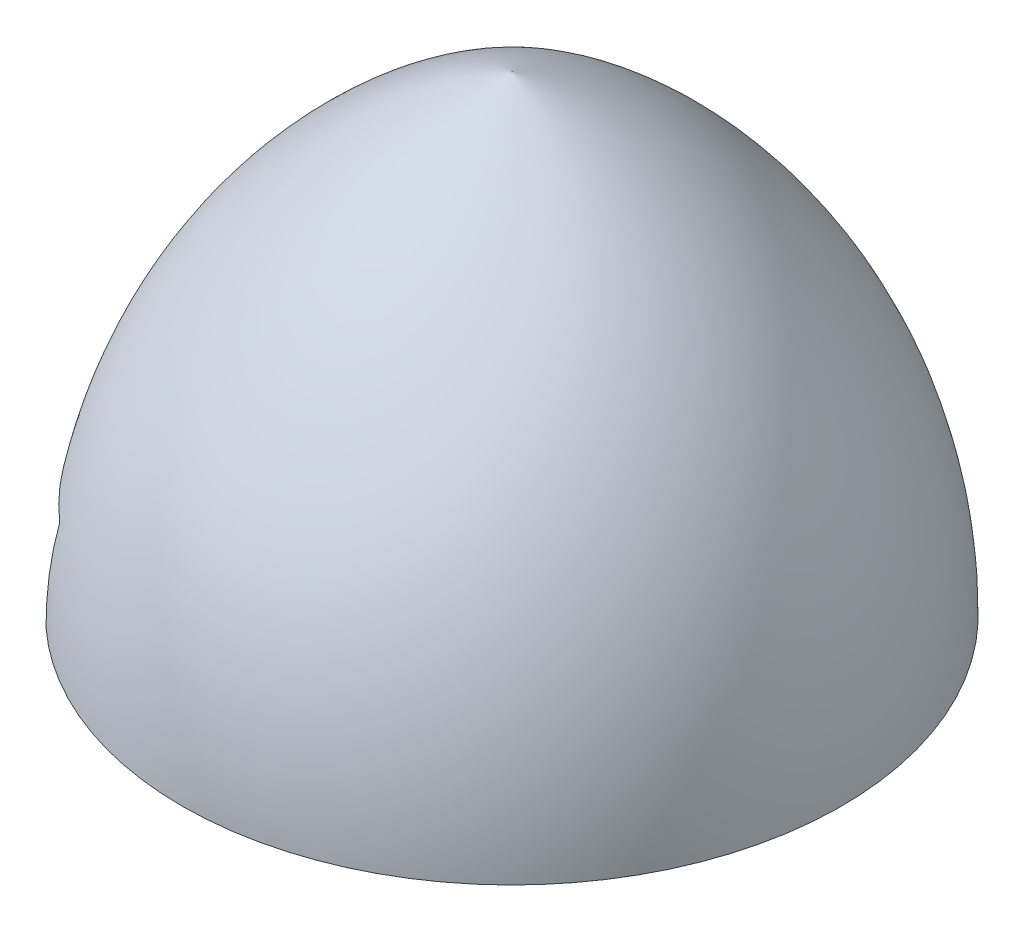
ISO-10303-21;
HEADER;
FILE_DESCRIPTION(('STEP AP214'),'2;1');
FILE_NAME('part.step','',(''),(''),'','','');
FILE_SCHEMA(('AUTOMOTIVE_DESIGN { 1 0 10303 214 1 1 1 1 }'));
ENDSEC;
DATA;
#1=APPLICATION_CONTEXT('core data for automotive mechanical design processes');
#2=APPLICATION_PROTOCOL_DEFINITION('international standard','automotive_design',2000,#1);
#3=PRODUCT_CONTEXT('',#1,'mechanical');
#4=PRODUCT('Part','Part','',(#3));
#5=PRODUCT_RELATED_PRODUCT_CATEGORY('part','',(#4));
#6=PRODUCT_DEFINITION_FORMATION('','',#4);
#7=PRODUCT_DEFINITION_CONTEXT('part definition',#1,'design');
#8=PRODUCT_DEFINITION('design','',#6,#7);
#9=PRODUCT_DEFINITION_SHAPE('','',#8);
#10=(LENGTH_UNIT() NAMED_UNIT(*) SI_UNIT(.MILLI.,.METRE.));
#11=(NAMED_UNIT(*) PLANE_ANGLE_UNIT() SI_UNIT($,.RADIAN.));
#12=(NAMED_UNIT(*) SI_UNIT($,.STERADIAN.) SOLID_ANGLE_UNIT());
#13=UNCERTAINTY_MEASURE_WITH_UNIT(LENGTH_MEASURE(1.E-05),#10,'distance_accuracy_value','');
#14=(GEOMETRIC_REPRESENTATION_CONTEXT(3) GLOBAL_UNCERTAINTY_ASSIGNED_CONTEXT((#13)) GLOBAL_UNIT_ASSIGNED_CONTEXT((#10,
#11,#12)) REPRESENTATION_CONTEXT('',''));
#15=CARTESIAN_POINT('',(0.,0.,0.));
#16=DIRECTION('',(0.,0.,1.));
#17=DIRECTION('',(1.,0.,0.));
#18=AXIS2_PLACEMENT_3D('',#15,#16,#17);
#19=CARTESIAN_POINT('',(0.,4.,0.));
#20=DIRECTION('',(0.,-1.,0.));
#21=DIRECTION('',(0.,0.,-1.));
#22=AXIS2_PLACEMENT_3D('',#19,#20,#21);
#23=CYLINDRICAL_SURFACE('',#22,1.);
#24=CARTESIAN_POINT('',(0.,3.00000000000001,0.));
#25=DIRECTION('',(0.,-1.,0.));
#26=DIRECTION('',(0.,0.,-1.));
#27=AXIS2_PLACEMENT_3D('',#24,#25,#26);
#28=CIRCLE('',#27,1.);
#29=CARTESIAN_POINT('',(0.,3.00000000000001,-1.));
#30=VERTEX_POINT('',#29);
#31=EDGE_CURVE('E11',#30,#30,#28,.F.);
#32=ORIENTED_EDGE('',*,*,#31,.T.);
#33=EDGE_LOOP('',(#32));
#34=FACE_BOUND('',#33,.T.);
#35=CARTESIAN_POINT('',(0.,1.02,0.));
#36=DIRECTION('',(0.,-1.,0.));
#37=DIRECTION('',(0.,0.,-1.));
#38=AXIS2_PLACEMENT_3D('',#35,#36,#37);
#39=CIRCLE('',#38,1.);
#40=CARTESIAN_POINT('',(0.,1.02,-1.));
#41=VERTEX_POINT('',#40);
#42=EDGE_CURVE('E46',#41,#41,#39,.F.);
#43=ORIENTED_EDGE('',*,*,#42,.F.);
#44=EDGE_LOOP('',(#43));
#45=FACE_BOUND('',#44,.T.);
#46=ADVANCED_FACE('F41',(#34,#45),#23,.F.);
#47=CARTESIAN_POINT('',(0.,3.00000000000001,0.));
#48=DIRECTION('',(0.,-1.,0.));
#49=DIRECTION('',(0.,0.,-1.));
#50=AXIS2_PLACEMENT_3D('',#47,#48,#49);
#51=CONICAL_SURFACE('',#50,1.,0.785398163397453);
#52=ORIENTED_EDGE('',*,*,#31,.F.);
#53=EDGE_LOOP('',(#52));
#54=FACE_BOUND('',#53,.T.);
#55=CARTESIAN_POINT('',(0.,4.,0.));
#56=VERTEX_POINT('',#55);
#57=VERTEX_LOOP('',#56);
#58=FACE_BOUND('',#57,.T.);
#59=ADVANCED_FACE('F44',(#54,#58),#51,.F.);
#60=CARTESIAN_POINT('',(-3.5,1.02,0.));
#61=DIRECTION('',(0.,-1.,0.));
#62=DIRECTION('',(0.,0.,-1.));
#63=AXIS2_PLACEMENT_3D('',#60,#61,#62);
#64=PLANE('',#63);
#65=DIRECTION('',(-0.989015863361917,0.,-0.147809411129611));
#66=VECTOR('',#65,1.);
#67=CARTESIAN_POINT('',(-3.5,1.02,-2.75));
#68=LINE('',#67,#66);
#69=CARTESIAN_POINT('',(1.,1.02,-2.07747049392892));
#70=VERTEX_POINT('',#69);
#71=CARTESIAN_POINT('',(-2.23793612855159,1.02,-2.56138329064548));
#72=VERTEX_POINT('',#71);
#73=EDGE_CURVE('E124',#70,#72,#68,.T.);
#74=ORIENTED_EDGE('',*,*,#73,.F.);
#75=CARTESIAN_POINT('',(0.689519954409057,1.02,0.));
#76=DIRECTION('',(0.,1.,0.));
#77=DIRECTION('',(0.,0.,-1.));
#78=AXIS2_PLACEMENT_3D('',#75,#76,#77);
#79=CIRCLE('',#78,2.10054314686831);
#80=CARTESIAN_POINT('',(1.,1.02,2.07747049392892));
#81=VERTEX_POINT('',#80);
#82=EDGE_CURVE('E110',#81,#70,#79,.T.);
#83=ORIENTED_EDGE('',*,*,#82,.F.);
#84=DIRECTION('',(0.989015863361917,0.,-0.147809411129611));
#85=VECTOR('',#84,1.);
#86=CARTESIAN_POINT('',(1.,1.02,2.07747049392892));
#87=LINE('',#86,#85);
#88=CARTESIAN_POINT('',(-2.23793612855159,1.02,2.56138329064548));
#89=VERTEX_POINT('',#88);
#90=EDGE_CURVE('E100',#89,#81,#87,.T.);
#91=ORIENTED_EDGE('',*,*,#90,.F.);
#92=CARTESIAN_POINT('',(0.,1.02,0.));
#93=DIRECTION('',(0.,-1.,0.));
#94=DIRECTION('',(0.,0.,-1.));
#95=AXIS2_PLACEMENT_3D('',#92,#93,#94);
#96=CIRCLE('',#95,3.40132951609725);
#97=CARTESIAN_POINT('',(-3.32236321101062,1.02,0.728659846017016));
#98=VERTEX_POINT('',#97);
#99=EDGE_CURVE('E138',#98,#89,#96,.F.);
#100=ORIENTED_EDGE('',*,*,#99,.F.);
#101=CARTESIAN_POINT('',(-3.5,1.02,0.));
#102=DIRECTION('',(0.,-1.,0.));
#103=DIRECTION('',(0.,0.,-1.));
#104=AXIS2_PLACEMENT_3D('',#101,#102,#103);
#105=CIRCLE('',#104,0.75);
#106=CARTESIAN_POINT('',(-3.32236321101062,1.02,-0.728659846017016));
#107=VERTEX_POINT('',#106);
#108=EDGE_CURVE('E111',#107,#98,#105,.T.);
#109=ORIENTED_EDGE('',*,*,#108,.F.);
#110=EDGE_CURVE('E140',#72,#107,#96,.F.);
#111=ORIENTED_EDGE('',*,*,#110,.F.);
#112=EDGE_LOOP('',(#74,#83,#91,#100,#109,#111));
#113=FACE_BOUND('',#112,.T.);
#114=ORIENTED_EDGE('',*,*,#42,.T.);
#115=EDGE_LOOP('',(#114));
#116=FACE_BOUND('',#115,.T.);
#117=ADVANCED_FACE('F122',(#113,#116),#64,.T.);
#118=CARTESIAN_POINT('',(-3.5,1.02,0.));
#119=DIRECTION('',(0.,-1.,0.));
#120=DIRECTION('',(0.,0.,-1.));
#121=AXIS2_PLACEMENT_3D('',#118,#119,#120);
#122=CYLINDRICAL_SURFACE('',#121,0.75);
#123=ORIENTED_EDGE('',*,*,#108,.T.);
#124=CARTESIAN_POINT('',(-3.41964285338447,-0.000199999999999999,0.745682726759719));
#125=CARTESIAN_POINT('',(-3.41965494592716,0.0854644521980473,0.74564974095591));
#126=CARTESIAN_POINT('',(-3.41758074848408,0.171127533899187,0.745460631057525));
#127=CARTESIAN_POINT('',(-3.40933632542107,0.342053963447284,0.744519986759328));
#128=CARTESIAN_POINT('',(-3.40317562536551,0.427317777609512,0.743769759795798));
#129=CARTESIAN_POINT('',(-3.38683420298955,0.597448055643923,0.741458885166234));
#130=CARTESIAN_POINT('',(-3.37665350094264,0.682314521517809,0.739898241587241));
#131=CARTESIAN_POINT('',(-3.35238782840216,0.851653271727084,0.735425907212351));
#132=CARTESIAN_POINT('',(-3.33829380524075,0.936124174636607,0.732511073119094));
#133=CARTESIAN_POINT('',(-3.32232524870102,1.0202,0.728650590304328));
#134=B_SPLINE_CURVE_WITH_KNOTS('',3,(#124,#125,#126,#127,#128,#129,#130,#131,#132,#133),
.UNSPECIFIED.,.F.,.F.,(4,2,2,2,4),(0.,0.256965601228471,0.513334315310817,0.769701736503807,
1.02666722446927),.UNSPECIFIED.);
#135=CARTESIAN_POINT('',(-3.41964285714286,0.,0.745682727164735));
#136=VERTEX_POINT('',#135);
#137=EDGE_CURVE('E172',#136,#98,#134,.T.);
#138=ORIENTED_EDGE('',*,*,#137,.F.);
#139=CARTESIAN_POINT('',(-3.5,0.,0.));
#140=DIRECTION('',(0.,-1.,0.));
#141=DIRECTION('',(0.,0.,-1.));
#142=AXIS2_PLACEMENT_3D('',#139,#140,#141);
#143=CIRCLE('',#142,0.75);
#144=CARTESIAN_POINT('',(-3.41964285714286,0.,-0.745682727164735));
#145=VERTEX_POINT('',#144);
#146=EDGE_CURVE('E129',#145,#136,#143,.T.);
#147=ORIENTED_EDGE('',*,*,#146,.F.);
#148=CARTESIAN_POINT('',(-3.32232524870102,1.0202,-0.728650590304328));
#149=CARTESIAN_POINT('',(-3.33829380524084,0.936124174636621,-0.732511073118658));
#150=CARTESIAN_POINT('',(-3.3523878284022,0.85165327172711,-0.735425907212133));
#151=CARTESIAN_POINT('',(-3.37665350094258,0.682314521517859,-0.739898241587457));
#152=CARTESIAN_POINT('',(-3.38683420298945,0.597448055643984,-0.741458885166667));
#153=CARTESIAN_POINT('',(-3.40317562536559,0.427317777609603,-0.743769759795363));
#154=CARTESIAN_POINT('',(-3.40933632542139,0.342053963447393,-0.744519986757808));
#155=CARTESIAN_POINT('',(-3.41758074848376,0.171127533899309,-0.745460631059046));
#156=CARTESIAN_POINT('',(-3.41965494592596,0.085464452198163,-0.745649740961569));
#157=CARTESIAN_POINT('',(-3.41964285338115,-0.00019999999990435,-0.745682726775406));
#158=B_SPLINE_CURVE_WITH_KNOTS('',3,(#148,#149,#150,#151,#152,#153,#154,#155,#156,#157),
.UNSPECIFIED.,.F.,.F.,(4,2,2,2,4),(0.,0.256965487965425,0.513332909158377,0.769701623240678,
1.02666722446914),.UNSPECIFIED.);
#159=EDGE_CURVE('E178',#107,#145,#158,.T.);
#160=ORIENTED_EDGE('',*,*,#159,.F.);
#161=EDGE_LOOP('',(#123,#138,#147,#160));
#162=FACE_BOUND('',#161,.T.);
#163=ADVANCED_FACE('F166',(#162),#122,.T.);
#164=CARTESIAN_POINT('',(1.,1.02,2.07747049392892));
#165=DIRECTION('',(-0.147809411129611,0.,-0.989015863361917));
#166=DIRECTION('',(-0.989015863361917,0.,0.147809411129611));
#167=AXIS2_PLACEMENT_3D('',#164,#165,#166);
#168=PLANE('',#167);
#169=ORIENTED_EDGE('',*,*,#90,.T.);
#170=DIRECTION('',(0.,-1.,0.));
#171=VECTOR('',#170,1.);
#172=CARTESIAN_POINT('',(1.,1.02,2.07747049392892));
#173=LINE('',#172,#171);
#174=CARTESIAN_POINT('',(1.,0.,2.07747049392892));
#175=VERTEX_POINT('',#174);
#176=EDGE_CURVE('E103',#81,#175,#173,.T.);
#177=ORIENTED_EDGE('',*,*,#176,.T.);
#178=DIRECTION('',(0.989015863361917,0.,-0.147809411129611));
#179=VECTOR('',#178,1.);
#180=CARTESIAN_POINT('',(1.,0.,2.07747049392892));
#181=LINE('',#180,#179);
#182=CARTESIAN_POINT('',(-2.36471815899395,0.,2.58033099204816));
#183=VERTEX_POINT('',#182);
#184=EDGE_CURVE('E132',#183,#175,#181,.T.);
#185=ORIENTED_EDGE('',*,*,#184,.F.);
#186=CARTESIAN_POINT('',(-2.23788542931092,1.0202,2.56137571359319));
#187=CARTESIAN_POINT('',(-2.25903165811034,0.936790859670747,2.56453603866202));
#188=CARTESIAN_POINT('',(-2.2775451186687,0.852714726609976,2.56730289388091));
#189=CARTESIAN_POINT('',(-2.30922720317878,0.683879646764396,2.57203781313577));
#190=CARTESIAN_POINT('',(-2.32241646033526,0.59912465976781,2.57400896082485));
#191=CARTESIAN_POINT('',(-2.35412754058675,0.343575897222151,2.5787482135223));
#192=CARTESIAN_POINT('',(-2.36473083862357,0.171743840844317,2.58033288703151));
#193=CARTESIAN_POINT('',(-2.36471815421116,-0.000199999999999844,2.58033099133337));
#194=B_SPLINE_CURVE_WITH_KNOTS('',3,(#186,#187,#188,#189,#190,#191,#192,#193),.UNSPECIFIED.,.F.,
.F.,(4,2,2,4),(0.,0.258246190854314,0.515481748685843,1.03070724628513),.UNSPECIFIED.);
#195=EDGE_CURVE('E106',#89,#183,#194,.T.);
#196=ORIENTED_EDGE('',*,*,#195,.F.);
#197=EDGE_LOOP('',(#169,#177,#185,#196));
#198=FACE_BOUND('',#197,.T.);
#199=ADVANCED_FACE('F102',(#198),#168,.T.);
#200=CARTESIAN_POINT('',(0.689519954409057,1.02,0.));
#201=DIRECTION('',(0.,-1.,0.));
#202=DIRECTION('',(0.,0.,-1.));
#203=AXIS2_PLACEMENT_3D('',#200,#201,#202);
#204=CYLINDRICAL_SURFACE('',#203,2.10054314686831);
#205=CARTESIAN_POINT('',(0.689519954409057,0.,0.));
#206=DIRECTION('',(0.,1.,0.));
#207=DIRECTION('',(0.,0.,-1.));
#208=AXIS2_PLACEMENT_3D('',#205,#206,#207);
#209=CIRCLE('',#208,2.10054314686831);
#210=CARTESIAN_POINT('',(1.,0.,-2.07747049392892));
#211=VERTEX_POINT('',#210);
#212=EDGE_CURVE('E117',#175,#211,#209,.T.);
#213=ORIENTED_EDGE('',*,*,#212,.F.);
#214=ORIENTED_EDGE('',*,*,#176,.F.);
#215=ORIENTED_EDGE('',*,*,#82,.T.);
#216=DIRECTION('',(0.,-1.,0.));
#217=VECTOR('',#216,1.);
#218=CARTESIAN_POINT('',(1.,1.02,-2.07747049392892));
#219=LINE('',#218,#217);
#220=EDGE_CURVE('E119',#70,#211,#219,.T.);
#221=ORIENTED_EDGE('',*,*,#220,.T.);
#222=EDGE_LOOP('',(#213,#214,#215,#221));
#223=FACE_BOUND('',#222,.T.);
#224=ADVANCED_FACE('F114',(#223),#204,.F.);
#225=CARTESIAN_POINT('',(-3.5,1.02,-2.75));
#226=DIRECTION('',(-0.147809411129611,0.,0.989015863361917));
#227=DIRECTION('',(0.989015863361917,0.,0.147809411129611));
#228=AXIS2_PLACEMENT_3D('',#225,#226,#227);
#229=PLANE('',#228);
#230=DIRECTION('',(-0.989015863361917,0.,-0.147809411129611));
#231=VECTOR('',#230,1.);
#232=CARTESIAN_POINT('',(-3.5,0.,-2.75));
#233=LINE('',#232,#231);
#234=CARTESIAN_POINT('',(-2.36471815899395,0.,-2.58033099204816));
#235=VERTEX_POINT('',#234);
#236=EDGE_CURVE('E135',#211,#235,#233,.T.);
#237=ORIENTED_EDGE('',*,*,#236,.F.);
#238=ORIENTED_EDGE('',*,*,#220,.F.);
#239=ORIENTED_EDGE('',*,*,#73,.T.);
#240=CARTESIAN_POINT('',(-2.36471815421116,-0.0002,-2.58033099133337));
#241=CARTESIAN_POINT('',(-2.36473083862357,0.171743840844318,-2.58033288703151));
#242=CARTESIAN_POINT('',(-2.35412754058675,0.34357589722215,-2.5787482135223));
#243=CARTESIAN_POINT('',(-2.32241646033526,0.599124659767809,-2.57400896082485));
#244=CARTESIAN_POINT('',(-2.30922720317878,0.683879646764396,-2.57203781313577));
#245=CARTESIAN_POINT('',(-2.2775451186687,0.852714726609975,-2.56730289388091));
#246=CARTESIAN_POINT('',(-2.25903165811034,0.936790859670747,-2.56453603866202));
#247=CARTESIAN_POINT('',(-2.23788542931092,1.0202,-2.56137571359319));
#248=B_SPLINE_CURVE_WITH_KNOTS('',3,(#240,#241,#242,#243,#244,#245,#246,#247),.UNSPECIFIED.,.F.,
.F.,(4,2,2,4),(0.,0.515225497599283,0.772461055430812,1.03070724628513),.UNSPECIFIED.);
#249=EDGE_CURVE('E58',#235,#72,#248,.T.);
#250=ORIENTED_EDGE('',*,*,#249,.F.);
#251=EDGE_LOOP('',(#237,#238,#239,#250));
#252=FACE_BOUND('',#251,.T.);
#253=ADVANCED_FACE('F156',(#252),#229,.T.);
#254=CARTESIAN_POINT('',(0.,0.,0.));
#255=DIRECTION('',(0.,-1.,0.));
#256=DIRECTION('',(0.,0.,-1.));
#257=AXIS2_PLACEMENT_3D('',#254,#255,#256);
#258=PLANE('',#257);
#259=CARTESIAN_POINT('',(0.,0.,0.));
#260=DIRECTION('',(0.,1.,0.));
#261=DIRECTION('',(0.,0.,1.));
#262=AXIS2_PLACEMENT_3D('',#259,#260,#261);
#263=CIRCLE('',#262,3.5);
#264=EDGE_CURVE('E185',#183,#235,#263,.T.);
#265=ORIENTED_EDGE('',*,*,#264,.F.);
#266=ORIENTED_EDGE('',*,*,#184,.T.);
#267=ORIENTED_EDGE('',*,*,#212,.T.);
#268=ORIENTED_EDGE('',*,*,#236,.T.);
#269=EDGE_LOOP('',(#265,#266,#267,#268));
#270=FACE_BOUND('',#269,.T.);
#271=ADVANCED_FACE('F161',(#270),#258,.T.);
#272=EDGE_CURVE('E51',#145,#136,#263,.T.);
#273=ORIENTED_EDGE('',*,*,#272,.F.);
#274=ORIENTED_EDGE('',*,*,#146,.T.);
#275=EDGE_LOOP('',(#273,#274));
#276=FACE_BOUND('',#275,.T.);
#277=ADVANCED_FACE('F194',(#276),#258,.T.);
#278=CARTESIAN_POINT('',(0.,0.,-1.82142857142857));
#279=DIRECTION('',(-1.,0.,0.));
#280=DIRECTION('',(0.,0.,1.));
#281=AXIS2_PLACEMENT_3D('',#278,#279,#280);
#282=CIRCLE('',#281,5.32142857142857);
#283=TRIMMED_CURVE('',#282,(PARAMETER_VALUE(-1.22145192877842)),
(PARAMETER_VALUE(1.22145192877842)),.T.,.PARAMETER.);
#284=CARTESIAN_POINT('',(0.,0.,0.));
#285=DIRECTION('',(0.,1.,0.));
#286=AXIS1_PLACEMENT('',#284,#285);
#287=SURFACE_OF_REVOLUTION('',#283,#286);
#288=CARTESIAN_POINT('',(0.,5.,0.));
#289=VERTEX_POINT('',#288);
#290=VERTEX_LOOP('',#289);
#291=FACE_BOUND('',#290,.T.);
#292=ORIENTED_EDGE('',*,*,#110,.T.);
#293=ORIENTED_EDGE('',*,*,#159,.T.);
#294=ORIENTED_EDGE('',*,*,#272,.T.);
#295=ORIENTED_EDGE('',*,*,#137,.T.);
#296=ORIENTED_EDGE('',*,*,#99,.T.);
#297=ORIENTED_EDGE('',*,*,#195,.T.);
#298=ORIENTED_EDGE('',*,*,#264,.T.);
#299=ORIENTED_EDGE('',*,*,#249,.T.);
#300=EDGE_LOOP('',(#292,#293,#294,#295,#296,#297,#298,#299));
#301=FACE_BOUND('',#300,.T.);
#302=ADVANCED_FACE('F153',(#291,#301),#287,.T.);
#303=CLOSED_SHELL('',(#46,#59,#117,#163,#199,#224,#253,#271,#277,#302));
#304=MANIFOLD_SOLID_BREP('B2',#303);
#305=ADVANCED_BREP_SHAPE_REPRESENTATION('',(#18,#304),#14);
#306=SHAPE_DEFINITION_REPRESENTATION(#9,#305);
ENDSEC;
END-ISO-10303-21;
